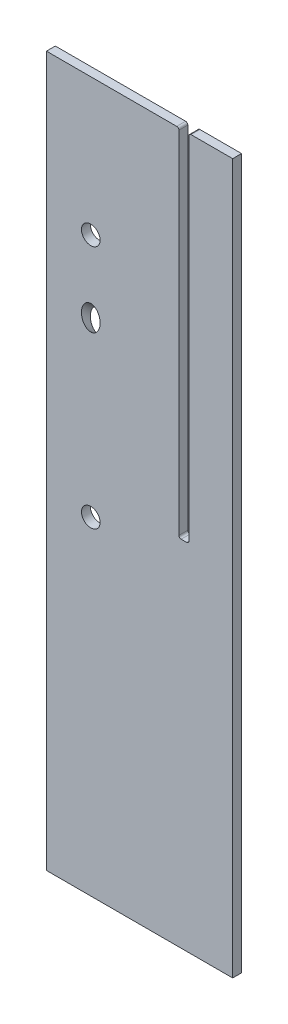
ISO-10303-21;
HEADER;
FILE_DESCRIPTION(('STEP AP214'),'2;1');
FILE_NAME('part.step','',(''),(''),'','','');
FILE_SCHEMA(('AUTOMOTIVE_DESIGN { 1 0 10303 214 1 1 1 1 }'));
ENDSEC;
DATA;
#1=APPLICATION_CONTEXT('core data for automotive mechanical design processes');
#2=APPLICATION_PROTOCOL_DEFINITION('international standard','automotive_design',2000,#1);
#3=PRODUCT_CONTEXT('',#1,'mechanical');
#4=PRODUCT('Part','Part','',(#3));
#5=PRODUCT_RELATED_PRODUCT_CATEGORY('part','',(#4));
#6=PRODUCT_DEFINITION_FORMATION('','',#4);
#7=PRODUCT_DEFINITION_CONTEXT('part definition',#1,'design');
#8=PRODUCT_DEFINITION('design','',#6,#7);
#9=PRODUCT_DEFINITION_SHAPE('','',#8);
#10=(LENGTH_UNIT() NAMED_UNIT(*) SI_UNIT(.MILLI.,.METRE.));
#11=(NAMED_UNIT(*) PLANE_ANGLE_UNIT() SI_UNIT($,.RADIAN.));
#12=(NAMED_UNIT(*) SI_UNIT($,.STERADIAN.) SOLID_ANGLE_UNIT());
#13=UNCERTAINTY_MEASURE_WITH_UNIT(LENGTH_MEASURE(1.E-05),#10,'distance_accuracy_value','');
#14=(GEOMETRIC_REPRESENTATION_CONTEXT(3) GLOBAL_UNCERTAINTY_ASSIGNED_CONTEXT((#13)) GLOBAL_UNIT_ASSIGNED_CONTEXT((#10,
#11,#12)) REPRESENTATION_CONTEXT('',''));
#15=CARTESIAN_POINT('',(0.,0.,0.));
#16=DIRECTION('',(0.,0.,1.));
#17=DIRECTION('',(1.,0.,0.));
#18=AXIS2_PLACEMENT_3D('',#15,#16,#17);
#19=CARTESIAN_POINT('',(-133.35,1016.,6.35));
#20=DIRECTION('',(0.,-1.,0.));
#21=DIRECTION('',(0.,0.,-1.));
#22=AXIS2_PLACEMENT_3D('',#19,#20,#21);
#23=PLANE('',#22);
#24=DIRECTION('',(-1.,0.,0.));
#25=VECTOR('',#24,1.);
#26=CARTESIAN_POINT('',(-133.35,1016.,-6.35));
#27=LINE('',#26,#25);
#28=CARTESIAN_POINT('',(133.35,1016.,-6.35));
#29=VERTEX_POINT('',#28);
#30=CARTESIAN_POINT('',(73.787,1016.,-6.35));
#31=VERTEX_POINT('',#30);
#32=EDGE_CURVE('E148',#29,#31,#27,.T.);
#33=ORIENTED_EDGE('',*,*,#32,.T.);
#34=DIRECTION('',(0.,0.,1.));
#35=VECTOR('',#34,1.);
#36=CARTESIAN_POINT('',(73.787,1016.,6.35));
#37=LINE('',#36,#35);
#38=CARTESIAN_POINT('',(73.787,1016.,6.35));
#39=VERTEX_POINT('',#38);
#40=EDGE_CURVE('E227',#31,#39,#37,.T.);
#41=ORIENTED_EDGE('',*,*,#40,.T.);
#42=DIRECTION('',(-1.,0.,0.));
#43=VECTOR('',#42,1.);
#44=CARTESIAN_POINT('',(-133.35,1016.,6.35));
#45=LINE('',#44,#43);
#46=CARTESIAN_POINT('',(133.35,1016.,6.35));
#47=VERTEX_POINT('',#46);
#48=EDGE_CURVE('E174',#47,#39,#45,.T.);
#49=ORIENTED_EDGE('',*,*,#48,.F.);
#50=DIRECTION('',(0.,0.,-1.));
#51=VECTOR('',#50,1.);
#52=CARTESIAN_POINT('',(133.35,1016.,6.35));
#53=LINE('',#52,#51);
#54=EDGE_CURVE('E187',#47,#29,#53,.T.);
#55=ORIENTED_EDGE('',*,*,#54,.T.);
#56=EDGE_LOOP('',(#33,#41,#49,#55));
#57=FACE_BOUND('',#56,.T.);
#58=ADVANCED_FACE('F44',(#57),#23,.F.);
#59=CARTESIAN_POINT('',(-133.35,0.,6.35));
#60=DIRECTION('',(1.,0.,0.));
#61=DIRECTION('',(0.,1.,0.));
#62=AXIS2_PLACEMENT_3D('',#59,#60,#61);
#63=PLANE('',#62);
#64=DIRECTION('',(0.,-1.,0.));
#65=VECTOR('',#64,1.);
#66=CARTESIAN_POINT('',(-133.35,0.,-6.35));
#67=LINE('',#66,#65);
#68=CARTESIAN_POINT('',(-133.35,1016.,-6.35));
#69=VERTEX_POINT('',#68);
#70=CARTESIAN_POINT('',(-133.35,0.,-6.35));
#71=VERTEX_POINT('',#70);
#72=EDGE_CURVE('E155',#69,#71,#67,.T.);
#73=ORIENTED_EDGE('',*,*,#72,.T.);
#74=DIRECTION('',(0.,0.,-1.));
#75=VECTOR('',#74,1.);
#76=CARTESIAN_POINT('',(-133.35,0.,6.35));
#77=LINE('',#76,#75);
#78=CARTESIAN_POINT('',(-133.35,0.,6.35));
#79=VERTEX_POINT('',#78);
#80=EDGE_CURVE('E328',#79,#71,#77,.T.);
#81=ORIENTED_EDGE('',*,*,#80,.F.);
#82=DIRECTION('',(0.,-1.,0.));
#83=VECTOR('',#82,1.);
#84=CARTESIAN_POINT('',(-133.35,0.,6.35));
#85=LINE('',#84,#83);
#86=CARTESIAN_POINT('',(-133.35,1016.,6.35));
#87=VERTEX_POINT('',#86);
#88=EDGE_CURVE('E157',#87,#79,#85,.T.);
#89=ORIENTED_EDGE('',*,*,#88,.F.);
#90=DIRECTION('',(0.,0.,-1.));
#91=VECTOR('',#90,1.);
#92=CARTESIAN_POINT('',(-133.35,1016.,6.35));
#93=LINE('',#92,#91);
#94=EDGE_CURVE('E141',#87,#69,#93,.T.);
#95=ORIENTED_EDGE('',*,*,#94,.T.);
#96=EDGE_LOOP('',(#73,#81,#89,#95));
#97=FACE_BOUND('',#96,.T.);
#98=ADVANCED_FACE('F153',(#97),#63,.F.);
#99=CARTESIAN_POINT('',(-133.35,0.,6.35));
#100=DIRECTION('',(0.,1.,0.));
#101=DIRECTION('',(-1.,0.,0.));
#102=AXIS2_PLACEMENT_3D('',#99,#100,#101);
#103=PLANE('',#102);
#104=DIRECTION('',(1.,0.,0.));
#105=VECTOR('',#104,1.);
#106=CARTESIAN_POINT('',(-133.35,0.,-6.35));
#107=LINE('',#106,#105);
#108=CARTESIAN_POINT('',(133.35,0.,-6.35));
#109=VERTEX_POINT('',#108);
#110=EDGE_CURVE('E159',#71,#109,#107,.T.);
#111=ORIENTED_EDGE('',*,*,#110,.T.);
#112=DIRECTION('',(0.,0.,-1.));
#113=VECTOR('',#112,1.);
#114=CARTESIAN_POINT('',(133.35,0.,6.35));
#115=LINE('',#114,#113);
#116=CARTESIAN_POINT('',(133.35,0.,6.35));
#117=VERTEX_POINT('',#116);
#118=EDGE_CURVE('E149',#117,#109,#115,.T.);
#119=ORIENTED_EDGE('',*,*,#118,.F.);
#120=DIRECTION('',(1.,0.,0.));
#121=VECTOR('',#120,1.);
#122=CARTESIAN_POINT('',(-133.35,0.,6.35));
#123=LINE('',#122,#121);
#124=EDGE_CURVE('E183',#79,#117,#123,.T.);
#125=ORIENTED_EDGE('',*,*,#124,.F.);
#126=ORIENTED_EDGE('',*,*,#80,.T.);
#127=EDGE_LOOP('',(#111,#119,#125,#126));
#128=FACE_BOUND('',#127,.T.);
#129=ADVANCED_FACE('F333',(#128),#103,.F.);
#130=CARTESIAN_POINT('',(133.35,0.,6.35));
#131=DIRECTION('',(-1.,0.,0.));
#132=DIRECTION('',(0.,0.,1.));
#133=AXIS2_PLACEMENT_3D('',#130,#131,#132);
#134=PLANE('',#133);
#135=DIRECTION('',(0.,1.,0.));
#136=VECTOR('',#135,1.);
#137=CARTESIAN_POINT('',(133.35,0.,-6.35));
#138=LINE('',#137,#136);
#139=EDGE_CURVE('E321',#109,#29,#138,.T.);
#140=ORIENTED_EDGE('',*,*,#139,.T.);
#141=ORIENTED_EDGE('',*,*,#54,.F.);
#142=DIRECTION('',(0.,1.,0.));
#143=VECTOR('',#142,1.);
#144=CARTESIAN_POINT('',(133.35,0.,6.35));
#145=LINE('',#144,#143);
#146=EDGE_CURVE('E180',#117,#47,#145,.T.);
#147=ORIENTED_EDGE('',*,*,#146,.F.);
#148=ORIENTED_EDGE('',*,*,#118,.T.);
#149=EDGE_LOOP('',(#140,#141,#147,#148));
#150=FACE_BOUND('',#149,.T.);
#151=ADVANCED_FACE('F320',(#150),#134,.F.);
#152=CARTESIAN_POINT('',(53.213,1016.,6.35));
#153=VERTEX_POINT('',#152);
#154=EDGE_CURVE('E179',#153,#87,#45,.T.);
#155=ORIENTED_EDGE('',*,*,#154,.F.);
#156=DIRECTION('',(0.,0.,1.));
#157=VECTOR('',#156,1.);
#158=CARTESIAN_POINT('',(53.213,1016.,6.35));
#159=LINE('',#158,#157);
#160=CARTESIAN_POINT('',(53.213,1016.,-6.35));
#161=VERTEX_POINT('',#160);
#162=EDGE_CURVE('E144',#153,#161,#159,.F.);
#163=ORIENTED_EDGE('',*,*,#162,.T.);
#164=EDGE_CURVE('E137',#161,#69,#27,.T.);
#165=ORIENTED_EDGE('',*,*,#164,.T.);
#166=ORIENTED_EDGE('',*,*,#94,.F.);
#167=EDGE_LOOP('',(#155,#163,#165,#166));
#168=FACE_BOUND('',#167,.T.);
#169=ADVANCED_FACE('F140',(#168),#23,.F.);
#170=CARTESIAN_POINT('',(0.,0.,6.35));
#171=DIRECTION('',(0.,0.,-1.));
#172=DIRECTION('',(-1.,0.,0.));
#173=AXIS2_PLACEMENT_3D('',#170,#171,#172);
#174=PLANE('',#173);
#175=CARTESIAN_POINT('',(-69.8499999999999,469.899999999998,6.34999999999999));
#176=DIRECTION('',(0.,0.,-1.));
#177=DIRECTION('',(-1.,0.,0.));
#178=AXIS2_PLACEMENT_3D('',#175,#176,#177);
#179=CIRCLE('',#178,13.335);
#180=CARTESIAN_POINT('',(-83.1849999999999,469.899999999998,6.34999999999999));
#181=VERTEX_POINT('',#180);
#182=EDGE_CURVE('E48',#181,#181,#179,.F.);
#183=ORIENTED_EDGE('',*,*,#182,.F.);
#184=EDGE_LOOP('',(#183));
#185=FACE_BOUND('',#184,.T.);
#186=CARTESIAN_POINT('',(-69.85,717.131250000006,6.34999999999999));
#187=DIRECTION('',(0.,0.,-1.));
#188=DIRECTION('',(0.,-1.,0.));
#189=AXIS2_PLACEMENT_3D('',#186,#187,#188);
#190=ELLIPSE('',#189,17.7191243016021,13.335);
#191=CARTESIAN_POINT('',(-69.85,699.412125698404,6.34999999999999));
#192=VERTEX_POINT('',#191);
#193=EDGE_CURVE('E260',#192,#192,#190,.F.);
#194=ORIENTED_EDGE('',*,*,#193,.F.);
#195=EDGE_LOOP('',(#194));
#196=FACE_BOUND('',#195,.T.);
#197=CARTESIAN_POINT('',(-69.85,819.899999999998,6.34999999999999));
#198=DIRECTION('',(0.,0.,-1.));
#199=DIRECTION('',(-1.,0.,0.));
#200=AXIS2_PLACEMENT_3D('',#197,#198,#199);
#201=CIRCLE('',#200,13.335);
#202=CARTESIAN_POINT('',(-83.185,819.899999999998,6.34999999999999));
#203=VERTEX_POINT('',#202);
#204=EDGE_CURVE('E255',#203,#203,#201,.F.);
#205=ORIENTED_EDGE('',*,*,#204,.F.);
#206=EDGE_LOOP('',(#205));
#207=FACE_BOUND('',#206,.T.);
#208=DIRECTION('',(0.,-1.,0.));
#209=VECTOR('',#208,1.);
#210=CARTESIAN_POINT('',(56.388,1016.,6.35));
#211=LINE('',#210,#209);
#212=CARTESIAN_POINT('',(56.388,1012.825,6.35));
#213=VERTEX_POINT('',#212);
#214=CARTESIAN_POINT('',(56.388,510.413,6.35));
#215=VERTEX_POINT('',#214);
#216=EDGE_CURVE('E198',#213,#215,#211,.T.);
#217=ORIENTED_EDGE('',*,*,#216,.F.);
#218=CARTESIAN_POINT('',(53.213,1012.825,6.35));
#219=DIRECTION('',(0.,0.,-1.));
#220=DIRECTION('',(-1.,0.,0.));
#221=AXIS2_PLACEMENT_3D('',#218,#219,#220);
#222=CIRCLE('',#221,3.175);
#223=EDGE_CURVE('E216',#213,#153,#222,.F.);
#224=ORIENTED_EDGE('',*,*,#223,.T.);
#225=ORIENTED_EDGE('',*,*,#154,.T.);
#226=ORIENTED_EDGE('',*,*,#88,.T.);
#227=ORIENTED_EDGE('',*,*,#124,.T.);
#228=ORIENTED_EDGE('',*,*,#146,.T.);
#229=ORIENTED_EDGE('',*,*,#48,.T.);
#230=CARTESIAN_POINT('',(73.787,1012.825,6.35));
#231=DIRECTION('',(0.,0.,-1.));
#232=DIRECTION('',(-1.,0.,0.));
#233=AXIS2_PLACEMENT_3D('',#230,#231,#232);
#234=CIRCLE('',#233,3.175);
#235=CARTESIAN_POINT('',(70.612,1012.825,6.35));
#236=VERTEX_POINT('',#235);
#237=EDGE_CURVE('E213',#39,#236,#234,.F.);
#238=ORIENTED_EDGE('',*,*,#237,.T.);
#239=DIRECTION('',(0.,1.,0.));
#240=VECTOR('',#239,1.);
#241=CARTESIAN_POINT('',(70.612,1016.,6.35));
#242=LINE('',#241,#240);
#243=CARTESIAN_POINT('',(70.6120000000001,510.413,6.35));
#244=VERTEX_POINT('',#243);
#245=EDGE_CURVE('E194',#244,#236,#242,.T.);
#246=ORIENTED_EDGE('',*,*,#245,.F.);
#247=CARTESIAN_POINT('',(67.4370000000001,510.413,6.35));
#248=DIRECTION('',(0.,0.,-1.));
#249=DIRECTION('',(-1.,0.,0.));
#250=AXIS2_PLACEMENT_3D('',#247,#248,#249);
#251=CIRCLE('',#250,3.175);
#252=CARTESIAN_POINT('',(67.4370000000001,507.238,6.35));
#253=VERTEX_POINT('',#252);
#254=EDGE_CURVE('E54',#244,#253,#251,.T.);
#255=ORIENTED_EDGE('',*,*,#254,.T.);
#256=DIRECTION('',(1.,0.,0.));
#257=VECTOR('',#256,1.);
#258=CARTESIAN_POINT('',(69.8500000000001,507.238,6.35));
#259=LINE('',#258,#257);
#260=CARTESIAN_POINT('',(59.563,507.238,6.35));
#261=VERTEX_POINT('',#260);
#262=EDGE_CURVE('E193',#261,#253,#259,.T.);
#263=ORIENTED_EDGE('',*,*,#262,.F.);
#264=CARTESIAN_POINT('',(59.563,510.413,6.35));
#265=DIRECTION('',(0.,0.,-1.));
#266=DIRECTION('',(-1.,0.,0.));
#267=AXIS2_PLACEMENT_3D('',#264,#265,#266);
#268=CIRCLE('',#267,3.175);
#269=EDGE_CURVE('E244',#261,#215,#268,.T.);
#270=ORIENTED_EDGE('',*,*,#269,.T.);
#271=EDGE_LOOP('',(#217,#224,#225,#226,#227,#228,#229,#238,#246,#255,#263,#270));
#272=FACE_BOUND('',#271,.T.);
#273=ADVANCED_FACE('F279',(#185,#196,#207,#272),#174,.F.);
#274=CARTESIAN_POINT('',(0.,0.,-6.35));
#275=DIRECTION('',(0.,0.,-1.));
#276=DIRECTION('',(-1.,0.,0.));
#277=AXIS2_PLACEMENT_3D('',#274,#275,#276);
#278=PLANE('',#277);
#279=ORIENTED_EDGE('',*,*,#164,.F.);
#280=CARTESIAN_POINT('',(53.213,1012.825,-6.35));
#281=DIRECTION('',(0.,0.,-1.));
#282=DIRECTION('',(-1.,0.,0.));
#283=AXIS2_PLACEMENT_3D('',#280,#281,#282);
#284=CIRCLE('',#283,3.175);
#285=CARTESIAN_POINT('',(56.388,1012.825,-6.35));
#286=VERTEX_POINT('',#285);
#287=EDGE_CURVE('E224',#161,#286,#284,.T.);
#288=ORIENTED_EDGE('',*,*,#287,.T.);
#289=DIRECTION('',(0.,-1.,0.));
#290=VECTOR('',#289,1.);
#291=CARTESIAN_POINT('',(56.388,1016.,-6.35));
#292=LINE('',#291,#290);
#293=CARTESIAN_POINT('',(56.388,510.413,-6.35));
#294=VERTEX_POINT('',#293);
#295=EDGE_CURVE('E169',#286,#294,#292,.T.);
#296=ORIENTED_EDGE('',*,*,#295,.T.);
#297=CARTESIAN_POINT('',(59.563,510.413,-6.35));
#298=DIRECTION('',(0.,0.,-1.));
#299=DIRECTION('',(-1.,0.,0.));
#300=AXIS2_PLACEMENT_3D('',#297,#298,#299);
#301=CIRCLE('',#300,3.175);
#302=CARTESIAN_POINT('',(59.563,507.238,-6.35));
#303=VERTEX_POINT('',#302);
#304=EDGE_CURVE('E69',#294,#303,#301,.F.);
#305=ORIENTED_EDGE('',*,*,#304,.T.);
#306=DIRECTION('',(1.,0.,0.));
#307=VECTOR('',#306,1.);
#308=CARTESIAN_POINT('',(69.8500000000001,507.238,-6.35));
#309=LINE('',#308,#307);
#310=CARTESIAN_POINT('',(67.4370000000001,507.238,-6.35));
#311=VERTEX_POINT('',#310);
#312=EDGE_CURVE('E166',#303,#311,#309,.T.);
#313=ORIENTED_EDGE('',*,*,#312,.T.);
#314=CARTESIAN_POINT('',(67.4370000000001,510.413,-6.35));
#315=DIRECTION('',(0.,0.,-1.));
#316=DIRECTION('',(-1.,0.,0.));
#317=AXIS2_PLACEMENT_3D('',#314,#315,#316);
#318=CIRCLE('',#317,3.175);
#319=CARTESIAN_POINT('',(70.6120000000001,510.413,-6.35));
#320=VERTEX_POINT('',#319);
#321=EDGE_CURVE('E12',#311,#320,#318,.F.);
#322=ORIENTED_EDGE('',*,*,#321,.T.);
#323=DIRECTION('',(0.,1.,0.));
#324=VECTOR('',#323,1.);
#325=CARTESIAN_POINT('',(70.612,1016.,-6.35));
#326=LINE('',#325,#324);
#327=CARTESIAN_POINT('',(70.612,1012.825,-6.35));
#328=VERTEX_POINT('',#327);
#329=EDGE_CURVE('E189',#320,#328,#326,.T.);
#330=ORIENTED_EDGE('',*,*,#329,.T.);
#331=CARTESIAN_POINT('',(73.787,1012.825,-6.35));
#332=DIRECTION('',(0.,0.,-1.));
#333=DIRECTION('',(-1.,0.,0.));
#334=AXIS2_PLACEMENT_3D('',#331,#332,#333);
#335=CIRCLE('',#334,3.175);
#336=EDGE_CURVE('E221',#328,#31,#335,.T.);
#337=ORIENTED_EDGE('',*,*,#336,.T.);
#338=ORIENTED_EDGE('',*,*,#32,.F.);
#339=ORIENTED_EDGE('',*,*,#139,.F.);
#340=ORIENTED_EDGE('',*,*,#110,.F.);
#341=ORIENTED_EDGE('',*,*,#72,.F.);
#342=EDGE_LOOP('',(#279,#288,#296,#305,#313,#322,#330,#337,#338,#339,#340,#341));
#343=FACE_BOUND('',#342,.T.);
#344=CARTESIAN_POINT('',(-69.8499999999999,469.899999999998,-6.34999999999999));
#345=DIRECTION('',(0.,0.,-1.));
#346=DIRECTION('',(-1.,0.,0.));
#347=AXIS2_PLACEMENT_3D('',#344,#345,#346);
#348=CIRCLE('',#347,13.335);
#349=CARTESIAN_POINT('',(-83.1849999999999,469.899999999998,-6.34999999999999));
#350=VERTEX_POINT('',#349);
#351=EDGE_CURVE('E178',#350,#350,#348,.F.);
#352=ORIENTED_EDGE('',*,*,#351,.T.);
#353=EDGE_LOOP('',(#352));
#354=FACE_BOUND('',#353,.T.);
#355=CARTESIAN_POINT('',(-69.85,706.018750000006,-6.34999999999999));
#356=DIRECTION('',(0.,0.,-1.));
#357=DIRECTION('',(0.,-1.,0.));
#358=AXIS2_PLACEMENT_3D('',#355,#356,#357);
#359=ELLIPSE('',#358,17.7191243016021,13.335);
#360=CARTESIAN_POINT('',(-69.85,688.299625698404,-6.34999999999999));
#361=VERTEX_POINT('',#360);
#362=EDGE_CURVE('E256',#361,#361,#359,.F.);
#363=ORIENTED_EDGE('',*,*,#362,.T.);
#364=EDGE_LOOP('',(#363));
#365=FACE_BOUND('',#364,.T.);
#366=CARTESIAN_POINT('',(-69.85,819.899999999998,-6.34999999999999));
#367=DIRECTION('',(0.,0.,-1.));
#368=DIRECTION('',(-1.,0.,0.));
#369=AXIS2_PLACEMENT_3D('',#366,#367,#368);
#370=CIRCLE('',#369,13.335);
#371=CARTESIAN_POINT('',(-83.185,819.899999999998,-6.34999999999999));
#372=VERTEX_POINT('',#371);
#373=EDGE_CURVE('E251',#372,#372,#370,.F.);
#374=ORIENTED_EDGE('',*,*,#373,.T.);
#375=EDGE_LOOP('',(#374));
#376=FACE_BOUND('',#375,.T.);
#377=ADVANCED_FACE('F161',(#343,#354,#365,#376),#278,.T.);
#378=CARTESIAN_POINT('',(-69.8499999999999,819.899999999998,123.799999999991));
#379=DIRECTION('',(0.,0.,-1.));
#380=DIRECTION('',(-1.,0.,0.));
#381=AXIS2_PLACEMENT_3D('',#378,#379,#380);
#382=CYLINDRICAL_SURFACE('',#381,13.335);
#383=ORIENTED_EDGE('',*,*,#373,.F.);
#384=EDGE_LOOP('',(#383));
#385=FACE_BOUND('',#384,.T.);
#386=ORIENTED_EDGE('',*,*,#204,.T.);
#387=EDGE_LOOP('',(#386));
#388=FACE_BOUND('',#387,.T.);
#389=ADVANCED_FACE('F439',(#385,#388),#382,.F.);
#390=CARTESIAN_POINT('',(-69.8499999999999,819.899999999998,123.799999999991));
#391=DIRECTION('',(0.,-0.658504607868519,-0.752576694706877));
#392=DIRECTION('',(0.,0.752576694706877,-0.658504607868519));
#393=AXIS2_PLACEMENT_3D('',#390,#391,#392);
#394=CYLINDRICAL_SURFACE('',#393,13.335);
#395=ORIENTED_EDGE('',*,*,#362,.F.);
#396=EDGE_LOOP('',(#395));
#397=FACE_BOUND('',#396,.T.);
#398=ORIENTED_EDGE('',*,*,#193,.T.);
#399=EDGE_LOOP('',(#398));
#400=FACE_BOUND('',#399,.T.);
#401=ADVANCED_FACE('F46',(#397,#400),#394,.F.);
#402=CARTESIAN_POINT('',(-69.8499999999999,469.899999999998,123.799999999994));
#403=DIRECTION('',(0.,0.,-1.));
#404=DIRECTION('',(-1.,0.,0.));
#405=AXIS2_PLACEMENT_3D('',#402,#403,#404);
#406=CYLINDRICAL_SURFACE('',#405,13.335);
#407=ORIENTED_EDGE('',*,*,#351,.F.);
#408=EDGE_LOOP('',(#407));
#409=FACE_BOUND('',#408,.T.);
#410=ORIENTED_EDGE('',*,*,#182,.T.);
#411=EDGE_LOOP('',(#410));
#412=FACE_BOUND('',#411,.T.);
#413=ADVANCED_FACE('F271',(#409,#412),#406,.F.);
#414=CARTESIAN_POINT('',(70.612,1016.,-6.35));
#415=DIRECTION('',(1.,0.,0.));
#416=DIRECTION('',(0.,1.,0.));
#417=AXIS2_PLACEMENT_3D('',#414,#415,#416);
#418=PLANE('',#417);
#419=ORIENTED_EDGE('',*,*,#245,.T.);
#420=DIRECTION('',(0.,0.,1.));
#421=VECTOR('',#420,1.);
#422=CARTESIAN_POINT('',(70.612,1012.825,-6.35));
#423=LINE('',#422,#421);
#424=EDGE_CURVE('E235',#236,#328,#423,.F.);
#425=ORIENTED_EDGE('',*,*,#424,.T.);
#426=ORIENTED_EDGE('',*,*,#329,.F.);
#427=DIRECTION('',(0.,0.,1.));
#428=VECTOR('',#427,1.);
#429=CARTESIAN_POINT('',(70.6120000000001,510.413,6.35));
#430=LINE('',#429,#428);
#431=EDGE_CURVE('E231',#320,#244,#430,.T.);
#432=ORIENTED_EDGE('',*,*,#431,.T.);
#433=EDGE_LOOP('',(#419,#425,#426,#432));
#434=FACE_BOUND('',#433,.T.);
#435=ADVANCED_FACE('F274',(#434),#418,.F.);
#436=CARTESIAN_POINT('',(69.8500000000001,507.238,-6.35));
#437=DIRECTION('',(0.,-1.,0.));
#438=DIRECTION('',(0.,0.,-1.));
#439=AXIS2_PLACEMENT_3D('',#436,#437,#438);
#440=PLANE('',#439);
#441=ORIENTED_EDGE('',*,*,#312,.F.);
#442=DIRECTION('',(0.,0.,1.));
#443=VECTOR('',#442,1.);
#444=CARTESIAN_POINT('',(59.563,507.238,6.35));
#445=LINE('',#444,#443);
#446=EDGE_CURVE('E240',#303,#261,#445,.T.);
#447=ORIENTED_EDGE('',*,*,#446,.T.);
#448=ORIENTED_EDGE('',*,*,#262,.T.);
#449=DIRECTION('',(0.,0.,1.));
#450=VECTOR('',#449,1.);
#451=CARTESIAN_POINT('',(67.4370000000001,507.238,-6.35));
#452=LINE('',#451,#450);
#453=EDGE_CURVE('E62',#253,#311,#452,.F.);
#454=ORIENTED_EDGE('',*,*,#453,.T.);
#455=EDGE_LOOP('',(#441,#447,#448,#454));
#456=FACE_BOUND('',#455,.T.);
#457=ADVANCED_FACE('F297',(#456),#440,.F.);
#458=CARTESIAN_POINT('',(56.388,1016.,-6.35));
#459=DIRECTION('',(-1.,0.,0.));
#460=DIRECTION('',(0.,-1.,0.));
#461=AXIS2_PLACEMENT_3D('',#458,#459,#460);
#462=PLANE('',#461);
#463=ORIENTED_EDGE('',*,*,#295,.F.);
#464=DIRECTION('',(0.,0.,1.));
#465=VECTOR('',#464,1.);
#466=CARTESIAN_POINT('',(56.388,1012.825,-6.35));
#467=LINE('',#466,#465);
#468=EDGE_CURVE('E209',#286,#213,#467,.T.);
#469=ORIENTED_EDGE('',*,*,#468,.T.);
#470=ORIENTED_EDGE('',*,*,#216,.T.);
#471=DIRECTION('',(0.,0.,1.));
#472=VECTOR('',#471,1.);
#473=CARTESIAN_POINT('',(56.388,510.413,-6.35));
#474=LINE('',#473,#472);
#475=EDGE_CURVE('E206',#215,#294,#474,.F.);
#476=ORIENTED_EDGE('',*,*,#475,.T.);
#477=EDGE_LOOP('',(#463,#469,#470,#476));
#478=FACE_BOUND('',#477,.T.);
#479=ADVANCED_FACE('F292',(#478),#462,.F.);
#480=CARTESIAN_POINT('',(53.213,1012.825,-6.35));
#481=DIRECTION('',(0.,0.,1.));
#482=DIRECTION('',(1.,0.,0.));
#483=AXIS2_PLACEMENT_3D('',#480,#481,#482);
#484=CYLINDRICAL_SURFACE('',#483,3.175);
#485=ORIENTED_EDGE('',*,*,#287,.F.);
#486=ORIENTED_EDGE('',*,*,#162,.F.);
#487=ORIENTED_EDGE('',*,*,#223,.F.);
#488=ORIENTED_EDGE('',*,*,#468,.F.);
#489=EDGE_LOOP('',(#485,#486,#487,#488));
#490=FACE_BOUND('',#489,.T.);
#491=ADVANCED_FACE('F336',(#490),#484,.T.);
#492=CARTESIAN_POINT('',(73.787,1012.825,6.35));
#493=DIRECTION('',(0.,0.,1.));
#494=DIRECTION('',(1.,0.,0.));
#495=AXIS2_PLACEMENT_3D('',#492,#493,#494);
#496=CYLINDRICAL_SURFACE('',#495,3.175);
#497=ORIENTED_EDGE('',*,*,#336,.F.);
#498=ORIENTED_EDGE('',*,*,#424,.F.);
#499=ORIENTED_EDGE('',*,*,#237,.F.);
#500=ORIENTED_EDGE('',*,*,#40,.F.);
#501=EDGE_LOOP('',(#497,#498,#499,#500));
#502=FACE_BOUND('',#501,.T.);
#503=ADVANCED_FACE('F311',(#502),#496,.T.);
#504=CARTESIAN_POINT('',(59.563,510.413,-6.35));
#505=DIRECTION('',(0.,0.,-1.));
#506=DIRECTION('',(-1.,0.,0.));
#507=AXIS2_PLACEMENT_3D('',#504,#505,#506);
#508=CYLINDRICAL_SURFACE('',#507,3.175);
#509=ORIENTED_EDGE('',*,*,#304,.F.);
#510=ORIENTED_EDGE('',*,*,#475,.F.);
#511=ORIENTED_EDGE('',*,*,#269,.F.);
#512=ORIENTED_EDGE('',*,*,#446,.F.);
#513=EDGE_LOOP('',(#509,#510,#511,#512));
#514=FACE_BOUND('',#513,.T.);
#515=ADVANCED_FACE('F295',(#514),#508,.F.);
#516=CARTESIAN_POINT('',(67.4370000000001,510.413,-6.35));
#517=DIRECTION('',(0.,0.,-1.));
#518=DIRECTION('',(-1.,0.,0.));
#519=AXIS2_PLACEMENT_3D('',#516,#517,#518);
#520=CYLINDRICAL_SURFACE('',#519,3.175);
#521=ORIENTED_EDGE('',*,*,#321,.F.);
#522=ORIENTED_EDGE('',*,*,#453,.F.);
#523=ORIENTED_EDGE('',*,*,#254,.F.);
#524=ORIENTED_EDGE('',*,*,#431,.F.);
#525=EDGE_LOOP('',(#521,#522,#523,#524));
#526=FACE_BOUND('',#525,.T.);
#527=ADVANCED_FACE('F302',(#526),#520,.F.);
#528=CLOSED_SHELL('',(#58,#98,#129,#151,#169,#273,#377,#389,#401,#413,#435,#457,#479,#491,#503,
#515,#527));
#529=MANIFOLD_SOLID_BREP('B2',#528);
#530=ADVANCED_BREP_SHAPE_REPRESENTATION('',(#18,#529),#14);
#531=SHAPE_DEFINITION_REPRESENTATION(#9,#530);
ENDSEC;
END-ISO-10303-21;
